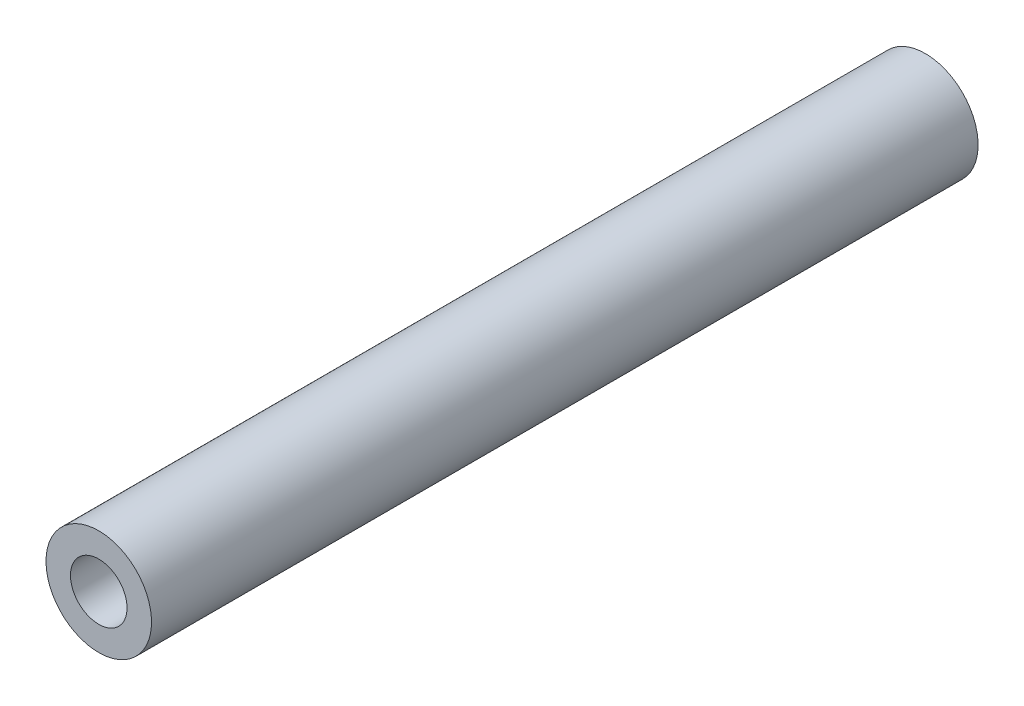
ISO-10303-21;
HEADER;
FILE_DESCRIPTION(('STEP AP214'),'2;1');
FILE_NAME('part.step','',(''),(''),'','','');
FILE_SCHEMA(('AUTOMOTIVE_DESIGN { 1 0 10303 214 1 1 1 1 }'));
ENDSEC;
DATA;
#1=APPLICATION_CONTEXT('core data for automotive mechanical design processes');
#2=APPLICATION_PROTOCOL_DEFINITION('international standard','automotive_design',2000,#1);
#3=PRODUCT_CONTEXT('',#1,'mechanical');
#4=PRODUCT('Part','Part','',(#3));
#5=PRODUCT_RELATED_PRODUCT_CATEGORY('part','',(#4));
#6=PRODUCT_DEFINITION_FORMATION('','',#4);
#7=PRODUCT_DEFINITION_CONTEXT('part definition',#1,'design');
#8=PRODUCT_DEFINITION('design','',#6,#7);
#9=PRODUCT_DEFINITION_SHAPE('','',#8);
#10=(LENGTH_UNIT() NAMED_UNIT(*) SI_UNIT(.MILLI.,.METRE.));
#11=(NAMED_UNIT(*) PLANE_ANGLE_UNIT() SI_UNIT($,.RADIAN.));
#12=(NAMED_UNIT(*) SI_UNIT($,.STERADIAN.) SOLID_ANGLE_UNIT());
#13=UNCERTAINTY_MEASURE_WITH_UNIT(LENGTH_MEASURE(1.E-05),#10,'distance_accuracy_value','');
#14=(GEOMETRIC_REPRESENTATION_CONTEXT(3) GLOBAL_UNCERTAINTY_ASSIGNED_CONTEXT((#13)) GLOBAL_UNIT_ASSIGNED_CONTEXT((#10,
#11,#12)) REPRESENTATION_CONTEXT('',''));
#15=CARTESIAN_POINT('',(0.,0.,0.));
#16=DIRECTION('',(0.,0.,1.));
#17=DIRECTION('',(1.,0.,0.));
#18=AXIS2_PLACEMENT_3D('',#15,#16,#17);
#19=CARTESIAN_POINT('',(0.,0.,37.30625));
#20=DIRECTION('',(0.,0.,-1.));
#21=DIRECTION('',(-1.,0.,0.));
#22=AXIS2_PLACEMENT_3D('',#19,#20,#21);
#23=CYLINDRICAL_SURFACE('',#22,2.5527);
#24=CARTESIAN_POINT('',(0.,0.,-37.30625));
#25=DIRECTION('',(0.,0.,-1.));
#26=DIRECTION('',(-1.,0.,0.));
#27=AXIS2_PLACEMENT_3D('',#24,#25,#26);
#28=CIRCLE('',#27,2.5527);
#29=CARTESIAN_POINT('',(-2.5527,0.,-37.30625));
#30=VERTEX_POINT('',#29);
#31=EDGE_CURVE('E26',#30,#30,#28,.T.);
#32=ORIENTED_EDGE('',*,*,#31,.T.);
#33=EDGE_LOOP('',(#32));
#34=FACE_BOUND('',#33,.T.);
#35=CARTESIAN_POINT('',(0.,0.,37.30625));
#36=DIRECTION('',(0.,0.,-1.));
#37=DIRECTION('',(-1.,0.,0.));
#38=AXIS2_PLACEMENT_3D('',#35,#36,#37);
#39=CIRCLE('',#38,2.5527);
#40=CARTESIAN_POINT('',(-2.5527,0.,37.30625));
#41=VERTEX_POINT('',#40);
#42=EDGE_CURVE('E17',#41,#41,#39,.T.);
#43=ORIENTED_EDGE('',*,*,#42,.F.);
#44=EDGE_LOOP('',(#43));
#45=FACE_BOUND('',#44,.T.);
#46=ADVANCED_FACE('F14',(#34,#45),#23,.F.);
#47=CARTESIAN_POINT('',(0.,0.,37.30625));
#48=DIRECTION('',(0.,0.,1.));
#49=DIRECTION('',(1.,0.,0.));
#50=AXIS2_PLACEMENT_3D('',#47,#48,#49);
#51=PLANE('',#50);
#52=ORIENTED_EDGE('',*,*,#42,.T.);
#53=EDGE_LOOP('',(#52));
#54=FACE_BOUND('',#53,.T.);
#55=CARTESIAN_POINT('',(0.,0.,37.30625));
#56=DIRECTION('',(0.,0.,-1.));
#57=DIRECTION('',(-1.,0.,0.));
#58=AXIS2_PLACEMENT_3D('',#55,#56,#57);
#59=CIRCLE('',#58,4.7625);
#60=CARTESIAN_POINT('',(-4.7625,0.,37.30625));
#61=VERTEX_POINT('',#60);
#62=EDGE_CURVE('E21',#61,#61,#59,.T.);
#63=ORIENTED_EDGE('',*,*,#62,.F.);
#64=EDGE_LOOP('',(#63));
#65=FACE_BOUND('',#64,.T.);
#66=ADVANCED_FACE('F34',(#54,#65),#51,.T.);
#67=CARTESIAN_POINT('',(0.,0.,-37.30625));
#68=DIRECTION('',(0.,0.,1.));
#69=DIRECTION('',(1.,0.,0.));
#70=AXIS2_PLACEMENT_3D('',#67,#68,#69);
#71=PLANE('',#70);
#72=ORIENTED_EDGE('',*,*,#31,.F.);
#73=EDGE_LOOP('',(#72));
#74=FACE_BOUND('',#73,.T.);
#75=CARTESIAN_POINT('',(0.,0.,-37.30625));
#76=DIRECTION('',(0.,0.,-1.));
#77=DIRECTION('',(-1.,0.,0.));
#78=AXIS2_PLACEMENT_3D('',#75,#76,#77);
#79=CIRCLE('',#78,4.7625);
#80=CARTESIAN_POINT('',(-4.7625,0.,-37.30625));
#81=VERTEX_POINT('',#80);
#82=EDGE_CURVE('E10',#81,#81,#79,.F.);
#83=ORIENTED_EDGE('',*,*,#82,.F.);
#84=EDGE_LOOP('',(#83));
#85=FACE_BOUND('',#84,.T.);
#86=ADVANCED_FACE('F42',(#74,#85),#71,.F.);
#87=CARTESIAN_POINT('',(0.,0.,37.30625));
#88=DIRECTION('',(0.,0.,-1.));
#89=DIRECTION('',(-1.,0.,0.));
#90=AXIS2_PLACEMENT_3D('',#87,#88,#89);
#91=CYLINDRICAL_SURFACE('',#90,4.7625);
#92=ORIENTED_EDGE('',*,*,#82,.T.);
#93=EDGE_LOOP('',(#92));
#94=FACE_BOUND('',#93,.T.);
#95=ORIENTED_EDGE('',*,*,#62,.T.);
#96=EDGE_LOOP('',(#95));
#97=FACE_BOUND('',#96,.T.);
#98=ADVANCED_FACE('F43',(#94,#97),#91,.T.);
#99=CLOSED_SHELL('',(#46,#66,#86,#98));
#100=MANIFOLD_SOLID_BREP('B1',#99);
#101=ADVANCED_BREP_SHAPE_REPRESENTATION('',(#18,#100),#14);
#102=SHAPE_DEFINITION_REPRESENTATION(#9,#101);
ENDSEC;
END-ISO-10303-21;
